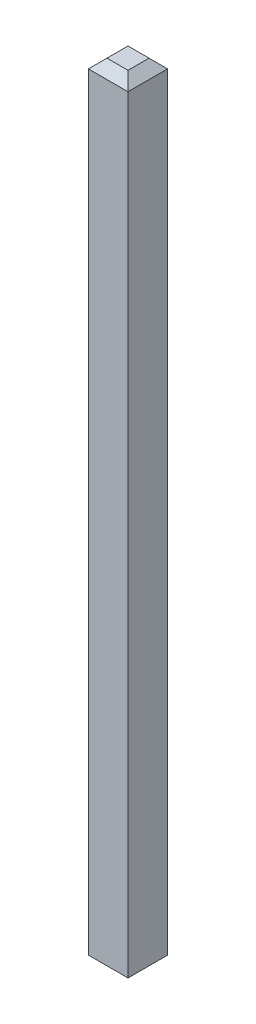
ISO-10303-21;
HEADER;
FILE_DESCRIPTION(('STEP AP214'),'2;1');
FILE_NAME('part.step','',(''),(''),'','','');
FILE_SCHEMA(('AUTOMOTIVE_DESIGN { 1 0 10303 214 1 1 1 1 }'));
ENDSEC;
DATA;
#1=APPLICATION_CONTEXT('core data for automotive mechanical design processes');
#2=APPLICATION_PROTOCOL_DEFINITION('international standard','automotive_design',2000,#1);
#3=PRODUCT_CONTEXT('',#1,'mechanical');
#4=PRODUCT('Part','Part','',(#3));
#5=PRODUCT_RELATED_PRODUCT_CATEGORY('part','',(#4));
#6=PRODUCT_DEFINITION_FORMATION('','',#4);
#7=PRODUCT_DEFINITION_CONTEXT('part definition',#1,'design');
#8=PRODUCT_DEFINITION('design','',#6,#7);
#9=PRODUCT_DEFINITION_SHAPE('','',#8);
#10=(LENGTH_UNIT() NAMED_UNIT(*) SI_UNIT(.MILLI.,.METRE.));
#11=(NAMED_UNIT(*) PLANE_ANGLE_UNIT() SI_UNIT($,.RADIAN.));
#12=(NAMED_UNIT(*) SI_UNIT($,.STERADIAN.) SOLID_ANGLE_UNIT());
#13=UNCERTAINTY_MEASURE_WITH_UNIT(LENGTH_MEASURE(1.E-05),#10,'distance_accuracy_value','');
#14=(GEOMETRIC_REPRESENTATION_CONTEXT(3) GLOBAL_UNCERTAINTY_ASSIGNED_CONTEXT((#13)) GLOBAL_UNIT_ASSIGNED_CONTEXT((#10,
#11,#12)) REPRESENTATION_CONTEXT('',''));
#15=CARTESIAN_POINT('',(0.,0.,0.));
#16=DIRECTION('',(0.,0.,1.));
#17=DIRECTION('',(1.,0.,0.));
#18=AXIS2_PLACEMENT_3D('',#15,#16,#17);
#19=CARTESIAN_POINT('',(2.295,-1.925,-0.16));
#20=DIRECTION('',(-0.707106781186548,-0.707106781186547,0.));
#21=DIRECTION('',(0.707106781186547,-0.707106781186548,0.));
#22=AXIS2_PLACEMENT_3D('',#19,#20,#21);
#23=PLANE('',#22);
#24=DIRECTION('',(0.,0.,1.));
#25=VECTOR('',#24,1.);
#26=CARTESIAN_POINT('',(2.22,-1.85,-0.32));
#27=LINE('',#26,#25);
#28=CARTESIAN_POINT('',(2.22,-1.85,-0.32));
#29=VERTEX_POINT('',#28);
#30=CARTESIAN_POINT('',(2.22,-1.85,0.32));
#31=VERTEX_POINT('',#30);
#32=EDGE_CURVE('E96',#29,#31,#27,.T.);
#33=ORIENTED_EDGE('',*,*,#32,.F.);
#34=DIRECTION('',(-0.577350269189626,0.577350269189626,-0.577350269189625));
#35=VECTOR('',#34,1.);
#36=CARTESIAN_POINT('',(2.37,-2.,-0.17));
#37=LINE('',#36,#35);
#38=CARTESIAN_POINT('',(2.37,-2.,-0.17));
#39=VERTEX_POINT('',#38);
#40=EDGE_CURVE('E94',#39,#29,#37,.T.);
#41=ORIENTED_EDGE('',*,*,#40,.F.);
#42=DIRECTION('',(0.,0.,1.));
#43=VECTOR('',#42,1.);
#44=CARTESIAN_POINT('',(2.37,-2.,0.));
#45=LINE('',#44,#43);
#46=CARTESIAN_POINT('',(2.37,-2.,0.17));
#47=VERTEX_POINT('',#46);
#48=EDGE_CURVE('E20',#39,#47,#45,.T.);
#49=ORIENTED_EDGE('',*,*,#48,.T.);
#50=DIRECTION('',(0.577350269189626,-0.577350269189626,-0.577350269189625));
#51=VECTOR('',#50,1.);
#52=CARTESIAN_POINT('',(2.22,-1.85,0.32));
#53=LINE('',#52,#51);
#54=EDGE_CURVE('E113',#31,#47,#53,.T.);
#55=ORIENTED_EDGE('',*,*,#54,.F.);
#56=EDGE_LOOP('',(#33,#41,#49,#55));
#57=FACE_BOUND('',#56,.T.);
#58=ADVANCED_FACE('F17',(#57),#23,.T.);
#59=CARTESIAN_POINT('',(2.295,10.625,-0.16));
#60=DIRECTION('',(-0.707106781186546,0.707106781186549,0.));
#61=DIRECTION('',(-0.707106781186549,-0.707106781186546,0.));
#62=AXIS2_PLACEMENT_3D('',#59,#60,#61);
#63=PLANE('',#62);
#64=DIRECTION('',(0.,0.,1.));
#65=VECTOR('',#64,1.);
#66=CARTESIAN_POINT('',(2.22,10.55,-0.32));
#67=LINE('',#66,#65);
#68=CARTESIAN_POINT('',(2.22,10.55,0.32));
#69=VERTEX_POINT('',#68);
#70=CARTESIAN_POINT('',(2.22,10.55,-0.32));
#71=VERTEX_POINT('',#70);
#72=EDGE_CURVE('E121',#69,#71,#67,.F.);
#73=ORIENTED_EDGE('',*,*,#72,.F.);
#74=DIRECTION('',(-0.577350269189627,-0.577350269189623,0.577350269189627));
#75=VECTOR('',#74,1.);
#76=CARTESIAN_POINT('',(2.37,10.7,0.170000000000001));
#77=LINE('',#76,#75);
#78=CARTESIAN_POINT('',(2.37,10.7,0.17));
#79=VERTEX_POINT('',#78);
#80=EDGE_CURVE('E118',#79,#69,#77,.T.);
#81=ORIENTED_EDGE('',*,*,#80,.F.);
#82=DIRECTION('',(0.,0.,1.));
#83=VECTOR('',#82,1.);
#84=CARTESIAN_POINT('',(2.37,10.7,0.));
#85=LINE('',#84,#83);
#86=CARTESIAN_POINT('',(2.37,10.7,-0.17));
#87=VERTEX_POINT('',#86);
#88=EDGE_CURVE('E79',#87,#79,#85,.T.);
#89=ORIENTED_EDGE('',*,*,#88,.F.);
#90=DIRECTION('',(0.577350269189627,0.577350269189623,0.577350269189627));
#91=VECTOR('',#90,1.);
#92=CARTESIAN_POINT('',(2.22,10.55,-0.320000000000001));
#93=LINE('',#92,#91);
#94=EDGE_CURVE('E106',#71,#87,#93,.T.);
#95=ORIENTED_EDGE('',*,*,#94,.F.);
#96=EDGE_LOOP('',(#73,#81,#89,#95));
#97=FACE_BOUND('',#96,.T.);
#98=ADVANCED_FACE('F283',(#97),#63,.T.);
#99=CARTESIAN_POINT('',(2.54,-2.,0.));
#100=DIRECTION('',(0.,1.,0.));
#101=DIRECTION('',(0.,0.,1.));
#102=AXIS2_PLACEMENT_3D('',#99,#100,#101);
#103=PLANE('',#102);
#104=DIRECTION('',(0.,0.,1.));
#105=VECTOR('',#104,1.);
#106=CARTESIAN_POINT('',(2.71,-2.,0.16));
#107=LINE('',#106,#105);
#108=CARTESIAN_POINT('',(2.71,-2.,0.17));
#109=VERTEX_POINT('',#108);
#110=CARTESIAN_POINT('',(2.71,-2.,-0.17));
#111=VERTEX_POINT('',#110);
#112=EDGE_CURVE('E127',#109,#111,#107,.F.);
#113=ORIENTED_EDGE('',*,*,#112,.F.);
#114=DIRECTION('',(1.,0.,0.));
#115=VECTOR('',#114,1.);
#116=CARTESIAN_POINT('',(2.38,-2.,0.17));
#117=LINE('',#116,#115);
#118=EDGE_CURVE('E90',#47,#109,#117,.T.);
#119=ORIENTED_EDGE('',*,*,#118,.F.);
#120=ORIENTED_EDGE('',*,*,#48,.F.);
#121=DIRECTION('',(1.,0.,0.));
#122=VECTOR('',#121,1.);
#123=CARTESIAN_POINT('',(2.7,-2.,-0.17));
#124=LINE('',#123,#122);
#125=EDGE_CURVE('E88',#111,#39,#124,.F.);
#126=ORIENTED_EDGE('',*,*,#125,.F.);
#127=EDGE_LOOP('',(#113,#119,#120,#126));
#128=FACE_BOUND('',#127,.T.);
#129=ADVANCED_FACE('F86',(#128),#103,.F.);
#130=CARTESIAN_POINT('',(2.7,-1.925,-0.245));
#131=DIRECTION('',(0.,-0.707106781186547,-0.707106781186548));
#132=DIRECTION('',(0.,0.707106781186548,-0.707106781186547));
#133=AXIS2_PLACEMENT_3D('',#130,#131,#132);
#134=PLANE('',#133);
#135=DIRECTION('',(-1.,0.,0.));
#136=VECTOR('',#135,1.);
#137=CARTESIAN_POINT('',(2.86,-1.85,-0.32));
#138=LINE('',#137,#136);
#139=CARTESIAN_POINT('',(2.86,-1.85,-0.32));
#140=VERTEX_POINT('',#139);
#141=EDGE_CURVE('E130',#140,#29,#138,.T.);
#142=ORIENTED_EDGE('',*,*,#141,.F.);
#143=DIRECTION('',(0.577350269189625,0.577350269189625,-0.577350269189626));
#144=VECTOR('',#143,1.);
#145=CARTESIAN_POINT('',(2.71,-2.,-0.17));
#146=LINE('',#145,#144);
#147=EDGE_CURVE('E102',#111,#140,#146,.T.);
#148=ORIENTED_EDGE('',*,*,#147,.F.);
#149=ORIENTED_EDGE('',*,*,#125,.T.);
#150=ORIENTED_EDGE('',*,*,#40,.T.);
#151=EDGE_LOOP('',(#142,#148,#149,#150));
#152=FACE_BOUND('',#151,.T.);
#153=ADVANCED_FACE('F100',(#152),#134,.T.);
#154=CARTESIAN_POINT('',(2.54,10.7,0.));
#155=DIRECTION('',(0.,1.,0.));
#156=DIRECTION('',(0.,0.,1.));
#157=AXIS2_PLACEMENT_3D('',#154,#155,#156);
#158=PLANE('',#157);
#159=ORIENTED_EDGE('',*,*,#88,.T.);
#160=DIRECTION('',(1.,0.,0.));
#161=VECTOR('',#160,1.);
#162=CARTESIAN_POINT('',(2.38,10.7,0.170000000000001));
#163=LINE('',#162,#161);
#164=CARTESIAN_POINT('',(2.71,10.7,0.17));
#165=VERTEX_POINT('',#164);
#166=EDGE_CURVE('E115',#165,#79,#163,.F.);
#167=ORIENTED_EDGE('',*,*,#166,.F.);
#168=DIRECTION('',(0.,0.,1.));
#169=VECTOR('',#168,1.);
#170=CARTESIAN_POINT('',(2.71,10.7,0.16));
#171=LINE('',#170,#169);
#172=CARTESIAN_POINT('',(2.71,10.7,-0.17));
#173=VERTEX_POINT('',#172);
#174=EDGE_CURVE('E139',#173,#165,#171,.T.);
#175=ORIENTED_EDGE('',*,*,#174,.F.);
#176=DIRECTION('',(1.,0.,0.));
#177=VECTOR('',#176,1.);
#178=CARTESIAN_POINT('',(2.7,10.7,-0.170000000000001));
#179=LINE('',#178,#177);
#180=EDGE_CURVE('E109',#87,#173,#179,.T.);
#181=ORIENTED_EDGE('',*,*,#180,.F.);
#182=EDGE_LOOP('',(#159,#167,#175,#181));
#183=FACE_BOUND('',#182,.T.);
#184=ADVANCED_FACE('F259',(#183),#158,.T.);
#185=CARTESIAN_POINT('',(2.7,10.625,-0.245));
#186=DIRECTION('',(0.,0.70710678118655,-0.707106781186545));
#187=DIRECTION('',(0.,0.707106781186545,0.70710678118655));
#188=AXIS2_PLACEMENT_3D('',#185,#186,#187);
#189=PLANE('',#188);
#190=ORIENTED_EDGE('',*,*,#180,.T.);
#191=DIRECTION('',(-0.577350269189628,0.577350269189623,0.577350269189627));
#192=VECTOR('',#191,1.);
#193=CARTESIAN_POINT('',(2.86,10.55,-0.32));
#194=LINE('',#193,#192);
#195=CARTESIAN_POINT('',(2.86,10.55,-0.32));
#196=VERTEX_POINT('',#195);
#197=EDGE_CURVE('E144',#196,#173,#194,.T.);
#198=ORIENTED_EDGE('',*,*,#197,.F.);
#199=DIRECTION('',(-1.,0.,0.));
#200=VECTOR('',#199,1.);
#201=CARTESIAN_POINT('',(2.86,10.55,-0.32));
#202=LINE('',#201,#200);
#203=EDGE_CURVE('E136',#71,#196,#202,.F.);
#204=ORIENTED_EDGE('',*,*,#203,.F.);
#205=ORIENTED_EDGE('',*,*,#94,.T.);
#206=EDGE_LOOP('',(#190,#198,#204,#205));
#207=FACE_BOUND('',#206,.T.);
#208=ADVANCED_FACE('F251',(#207),#189,.T.);
#209=CARTESIAN_POINT('',(2.38,-1.925,0.245));
#210=DIRECTION('',(0.,-0.707106781186547,0.707106781186548));
#211=DIRECTION('',(0.,-0.707106781186548,-0.707106781186547));
#212=AXIS2_PLACEMENT_3D('',#209,#210,#211);
#213=PLANE('',#212);
#214=DIRECTION('',(1.,0.,0.));
#215=VECTOR('',#214,1.);
#216=CARTESIAN_POINT('',(2.22,-1.85,0.32));
#217=LINE('',#216,#215);
#218=CARTESIAN_POINT('',(2.86,-1.85,0.32));
#219=VERTEX_POINT('',#218);
#220=EDGE_CURVE('E147',#31,#219,#217,.T.);
#221=ORIENTED_EDGE('',*,*,#220,.F.);
#222=ORIENTED_EDGE('',*,*,#54,.T.);
#223=ORIENTED_EDGE('',*,*,#118,.T.);
#224=DIRECTION('',(-0.577350269189626,-0.577350269189626,-0.577350269189626));
#225=VECTOR('',#224,1.);
#226=CARTESIAN_POINT('',(2.86,-1.85,0.32));
#227=LINE('',#226,#225);
#228=EDGE_CURVE('E124',#219,#109,#227,.T.);
#229=ORIENTED_EDGE('',*,*,#228,.F.);
#230=EDGE_LOOP('',(#221,#222,#223,#229));
#231=FACE_BOUND('',#230,.T.);
#232=ADVANCED_FACE('F173',(#231),#213,.T.);
#233=CARTESIAN_POINT('',(2.38,10.625,0.245));
#234=DIRECTION('',(0.,0.70710678118655,0.707106781186545));
#235=DIRECTION('',(0.,-0.707106781186545,0.70710678118655));
#236=AXIS2_PLACEMENT_3D('',#233,#234,#235);
#237=PLANE('',#236);
#238=DIRECTION('',(1.,0.,0.));
#239=VECTOR('',#238,1.);
#240=CARTESIAN_POINT('',(2.22,10.55,0.32));
#241=LINE('',#240,#239);
#242=CARTESIAN_POINT('',(2.86,10.55,0.32));
#243=VERTEX_POINT('',#242);
#244=EDGE_CURVE('E35',#243,#69,#241,.F.);
#245=ORIENTED_EDGE('',*,*,#244,.F.);
#246=DIRECTION('',(0.577350269189628,-0.577350269189623,0.577350269189627));
#247=VECTOR('',#246,1.);
#248=CARTESIAN_POINT('',(2.71,10.7,0.17));
#249=LINE('',#248,#247);
#250=EDGE_CURVE('E142',#165,#243,#249,.T.);
#251=ORIENTED_EDGE('',*,*,#250,.F.);
#252=ORIENTED_EDGE('',*,*,#166,.T.);
#253=ORIENTED_EDGE('',*,*,#80,.T.);
#254=EDGE_LOOP('',(#245,#251,#252,#253));
#255=FACE_BOUND('',#254,.T.);
#256=ADVANCED_FACE('F190',(#255),#237,.T.);
#257=CARTESIAN_POINT('',(2.22,-2.,-0.32));
#258=DIRECTION('',(-1.,0.,0.));
#259=DIRECTION('',(0.,0.,1.));
#260=AXIS2_PLACEMENT_3D('',#257,#258,#259);
#261=PLANE('',#260);
#262=ORIENTED_EDGE('',*,*,#72,.T.);
#263=DIRECTION('',(0.,1.,0.));
#264=VECTOR('',#263,1.);
#265=CARTESIAN_POINT('',(2.22,-2.,-0.32));
#266=LINE('',#265,#264);
#267=EDGE_CURVE('E133',#29,#71,#266,.T.);
#268=ORIENTED_EDGE('',*,*,#267,.F.);
#269=ORIENTED_EDGE('',*,*,#32,.T.);
#270=DIRECTION('',(0.,1.,0.));
#271=VECTOR('',#270,1.);
#272=CARTESIAN_POINT('',(2.22,-2.,0.32));
#273=LINE('',#272,#271);
#274=EDGE_CURVE('E151',#69,#31,#273,.F.);
#275=ORIENTED_EDGE('',*,*,#274,.F.);
#276=EDGE_LOOP('',(#262,#268,#269,#275));
#277=FACE_BOUND('',#276,.T.);
#278=ADVANCED_FACE('F176',(#277),#261,.T.);
#279=CARTESIAN_POINT('',(2.785,-1.925,0.16));
#280=DIRECTION('',(0.707106781186548,-0.707106781186548,0.));
#281=DIRECTION('',(0.707106781186548,0.707106781186548,0.));
#282=AXIS2_PLACEMENT_3D('',#279,#280,#281);
#283=PLANE('',#282);
#284=ORIENTED_EDGE('',*,*,#112,.T.);
#285=ORIENTED_EDGE('',*,*,#147,.T.);
#286=DIRECTION('',(0.,0.,-1.));
#287=VECTOR('',#286,1.);
#288=CARTESIAN_POINT('',(2.86,-1.85,0.32));
#289=LINE('',#288,#287);
#290=EDGE_CURVE('E154',#219,#140,#289,.T.);
#291=ORIENTED_EDGE('',*,*,#290,.F.);
#292=ORIENTED_EDGE('',*,*,#228,.T.);
#293=EDGE_LOOP('',(#284,#285,#291,#292));
#294=FACE_BOUND('',#293,.T.);
#295=ADVANCED_FACE('F181',(#294),#283,.T.);
#296=CARTESIAN_POINT('',(2.86,-2.,-0.32));
#297=DIRECTION('',(0.,0.,-1.));
#298=DIRECTION('',(-1.,0.,0.));
#299=AXIS2_PLACEMENT_3D('',#296,#297,#298);
#300=PLANE('',#299);
#301=ORIENTED_EDGE('',*,*,#203,.T.);
#302=DIRECTION('',(0.,1.,0.));
#303=VECTOR('',#302,1.);
#304=CARTESIAN_POINT('',(2.86,-2.,-0.32));
#305=LINE('',#304,#303);
#306=EDGE_CURVE('E157',#140,#196,#305,.T.);
#307=ORIENTED_EDGE('',*,*,#306,.F.);
#308=ORIENTED_EDGE('',*,*,#141,.T.);
#309=ORIENTED_EDGE('',*,*,#267,.T.);
#310=EDGE_LOOP('',(#301,#307,#308,#309));
#311=FACE_BOUND('',#310,.T.);
#312=ADVANCED_FACE('F179',(#311),#300,.T.);
#313=CARTESIAN_POINT('',(2.785,10.625,0.16));
#314=DIRECTION('',(0.707106781186545,0.70710678118655,0.));
#315=DIRECTION('',(-0.70710678118655,0.707106781186545,0.));
#316=AXIS2_PLACEMENT_3D('',#313,#314,#315);
#317=PLANE('',#316);
#318=DIRECTION('',(0.,0.,-1.));
#319=VECTOR('',#318,1.);
#320=CARTESIAN_POINT('',(2.86,10.55,0.32));
#321=LINE('',#320,#319);
#322=EDGE_CURVE('E26',#196,#243,#321,.F.);
#323=ORIENTED_EDGE('',*,*,#322,.F.);
#324=ORIENTED_EDGE('',*,*,#197,.T.);
#325=ORIENTED_EDGE('',*,*,#174,.T.);
#326=ORIENTED_EDGE('',*,*,#250,.T.);
#327=EDGE_LOOP('',(#323,#324,#325,#326));
#328=FACE_BOUND('',#327,.T.);
#329=ADVANCED_FACE('F167',(#328),#317,.T.);
#330=CARTESIAN_POINT('',(2.22,-2.,0.32));
#331=DIRECTION('',(0.,0.,1.));
#332=DIRECTION('',(1.,0.,0.));
#333=AXIS2_PLACEMENT_3D('',#330,#331,#332);
#334=PLANE('',#333);
#335=ORIENTED_EDGE('',*,*,#244,.T.);
#336=ORIENTED_EDGE('',*,*,#274,.T.);
#337=ORIENTED_EDGE('',*,*,#220,.T.);
#338=DIRECTION('',(0.,1.,0.));
#339=VECTOR('',#338,1.);
#340=CARTESIAN_POINT('',(2.86,-2.,0.32));
#341=LINE('',#340,#339);
#342=EDGE_CURVE('E11',#243,#219,#341,.F.);
#343=ORIENTED_EDGE('',*,*,#342,.F.);
#344=EDGE_LOOP('',(#335,#336,#337,#343));
#345=FACE_BOUND('',#344,.T.);
#346=ADVANCED_FACE('F169',(#345),#334,.T.);
#347=CARTESIAN_POINT('',(2.86,-2.,0.32));
#348=DIRECTION('',(1.,0.,0.));
#349=DIRECTION('',(0.,0.,-1.));
#350=AXIS2_PLACEMENT_3D('',#347,#348,#349);
#351=PLANE('',#350);
#352=ORIENTED_EDGE('',*,*,#322,.T.);
#353=ORIENTED_EDGE('',*,*,#342,.T.);
#354=ORIENTED_EDGE('',*,*,#290,.T.);
#355=ORIENTED_EDGE('',*,*,#306,.T.);
#356=EDGE_LOOP('',(#352,#353,#354,#355));
#357=FACE_BOUND('',#356,.T.);
#358=ADVANCED_FACE('F163',(#357),#351,.T.);
#359=CLOSED_SHELL('',(#58,#98,#129,#153,#184,#208,#232,#256,#278,#295,#312,#329,#346,#358));
#360=MANIFOLD_SOLID_BREP('B1',#359);
#361=ADVANCED_BREP_SHAPE_REPRESENTATION('',(#18,#360),#14);
#362=SHAPE_DEFINITION_REPRESENTATION(#9,#361);
ENDSEC;
END-ISO-10303-21;
